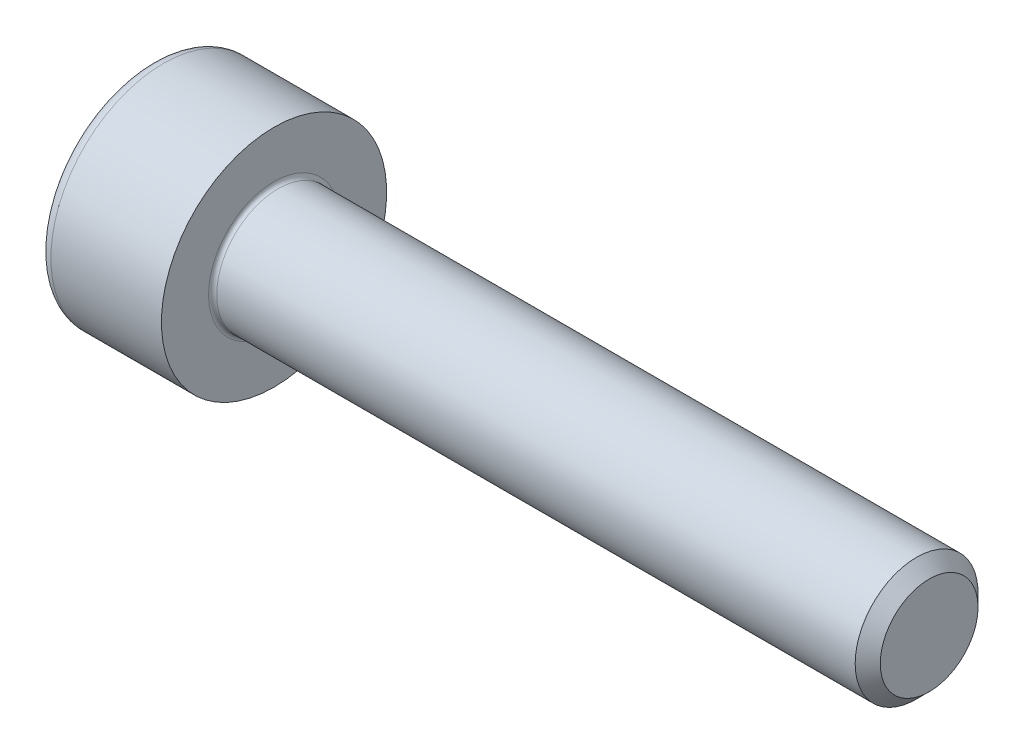
ISO-10303-21;
HEADER;
FILE_DESCRIPTION(('STEP AP214'),'2;1');
FILE_NAME('part.step','',(''),(''),'','','');
FILE_SCHEMA(('AUTOMOTIVE_DESIGN { 1 0 10303 214 1 1 1 1 }'));
ENDSEC;
DATA;
#1=APPLICATION_CONTEXT('core data for automotive mechanical design processes');
#2=APPLICATION_PROTOCOL_DEFINITION('international standard','automotive_design',2000,#1);
#3=PRODUCT_CONTEXT('',#1,'mechanical');
#4=PRODUCT('Part','Part','',(#3));
#5=PRODUCT_RELATED_PRODUCT_CATEGORY('part','',(#4));
#6=PRODUCT_DEFINITION_FORMATION('','',#4);
#7=PRODUCT_DEFINITION_CONTEXT('part definition',#1,'design');
#8=PRODUCT_DEFINITION('design','',#6,#7);
#9=PRODUCT_DEFINITION_SHAPE('','',#8);
#10=(LENGTH_UNIT() NAMED_UNIT(*) SI_UNIT(.MILLI.,.METRE.));
#11=(NAMED_UNIT(*) PLANE_ANGLE_UNIT() SI_UNIT($,.RADIAN.));
#12=(NAMED_UNIT(*) SI_UNIT($,.STERADIAN.) SOLID_ANGLE_UNIT());
#13=UNCERTAINTY_MEASURE_WITH_UNIT(LENGTH_MEASURE(1.E-05),#10,'distance_accuracy_value','');
#14=(GEOMETRIC_REPRESENTATION_CONTEXT(3) GLOBAL_UNCERTAINTY_ASSIGNED_CONTEXT((#13)) GLOBAL_UNIT_ASSIGNED_CONTEXT((#10,
#11,#12)) REPRESENTATION_CONTEXT('',''));
#15=CARTESIAN_POINT('',(0.,0.,0.));
#16=DIRECTION('',(0.,0.,1.));
#17=DIRECTION('',(1.,0.,0.));
#18=AXIS2_PLACEMENT_3D('',#15,#16,#17);
#19=CARTESIAN_POINT('',(-1.50499999995191,0.,0.));
#20=DIRECTION('',(-1.,0.,0.));
#21=DIRECTION('',(0.,0.,1.));
#22=AXIS2_PLACEMENT_3D('',#19,#20,#21);
#23=CONICAL_SURFACE('',#22,1.45203592694543,1.04719755110347);
#24=CARTESIAN_POINT('',(-0.666666666631954,-5.6843418860808E-11,0.));
#25=VERTEX_POINT('',#24);
#26=VERTEX_LOOP('',#25);
#27=FACE_BOUND('',#26,.T.);
#28=CARTESIAN_POINT('',(-1.49999999999004,1.25,0.721687836489904));
#29=CARTESIAN_POINT('',(-1.48168471568985,1.25,0.658260217059865));
#30=CARTESIAN_POINT('',(-1.46502792316932,1.25,0.594285091321008));
#31=CARTESIAN_POINT('',(-1.43595399209987,1.25,0.465227153334786));
#32=CARTESIAN_POINT('',(-1.42354713768306,1.25,0.40014204872408));
#33=CARTESIAN_POINT('',(-1.40423497430876,1.25,0.270778406577996));
#34=CARTESIAN_POINT('',(-1.3972011172141,1.25,0.206519767721449));
#35=CARTESIAN_POINT('',(-1.38880573004626,1.25,0.0777002896277511));
#36=CARTESIAN_POINT('',(-1.38743724619873,1.25,0.0131399182931021));
#37=CARTESIAN_POINT('',(-1.39029143131319,1.25,-0.10748420967335));
#38=CARTESIAN_POINT('',(-1.39381330322771,1.25,-0.163566066938273));
#39=CARTESIAN_POINT('',(-1.40497331291925,1.25,-0.275364426461425));
#40=CARTESIAN_POINT('',(-1.41261525920259,1.25,-0.331080542327595));
#41=CARTESIAN_POINT('',(-1.4317186458128,1.25,-0.443109217014839));
#42=CARTESIAN_POINT('',(-1.44326102636524,1.25,-0.49940760424794));
#43=CARTESIAN_POINT('',(-1.46945735050873,1.25,-0.611164931126897));
#44=CARTESIAN_POINT('',(-1.48410514295715,1.25,-0.666625301408834));
#45=CARTESIAN_POINT('',(-1.49999999999004,1.25,-0.721687836489906));
#46=B_SPLINE_CURVE_WITH_KNOTS('',3,(#28,#29,#30,#31,#32,#33,#34,#35,#36,#37,#38,#39,#40,#41,#42,
#43,#44,#45),.UNSPECIFIED.,.F.,.F.,(4,2,2,2,2,2,2,2,4),(0.,0.198135007230316,0.396746135656778,
0.590442253865621,0.783900555586254,0.952317364166839,1.12089012114027,1.2932010140725,
1.46517373346208),.UNSPECIFIED.);
#47=CARTESIAN_POINT('',(-1.49999999999004,1.25000000000124,0.721687836487752));
#48=VERTEX_POINT('',#47);
#49=CARTESIAN_POINT('',(-1.49999999998963,1.25,-0.721687836488469));
#50=VERTEX_POINT('',#49);
#51=EDGE_CURVE('E20',#48,#50,#46,.T.);
#52=ORIENTED_EDGE('',*,*,#51,.T.);
#53=CARTESIAN_POINT('',(-1.49999999999004,1.25000000000249,-0.721687836485598));
#54=CARTESIAN_POINT('',(-1.48168471568985,1.1950700702745,-0.753401646200618));
#55=CARTESIAN_POINT('',(-1.46502792316932,1.13966598617435,-0.785389209070047));
#56=CARTESIAN_POINT('',(-1.43595399209987,1.02789853331824,-0.849918178063157));
#57=CARTESIAN_POINT('',(-1.42354713768306,0.971533179317402,-0.88246073036851));
#58=CARTESIAN_POINT('',(-1.40423497430876,0.859500978892814,-0.947142551441552));
#59=CARTESIAN_POINT('',(-1.3972011172141,0.803851365230435,-0.979271870869826));
#60=CARTESIAN_POINT('',(-1.38880573004627,0.692290424699039,-1.04368160991667));
#61=CARTESIAN_POINT('',(-1.38743724619873,0.636379503045476,-1.075961795584));
#62=CARTESIAN_POINT('',(-1.3902914313132,0.531915943917184,-1.13627385956723));
#63=CARTESIAN_POINT('',(-1.39381330322771,0.483347630834347,-1.16431478819969));
#64=CARTESIAN_POINT('',(-1.40497331291925,0.386527411385872,-1.22021396796126));
#65=CARTESIAN_POINT('',(-1.41261525920259,0.338275839645572,-1.24807202589435));
#66=CARTESIAN_POINT('',(-1.4317186458128,0.241256161414117,-1.30408636323797));
#67=CARTESIAN_POINT('',(-1.44326102636524,0.192500327878158,-1.33223555685452));
#68=CARTESIAN_POINT('',(-1.46945735050873,0.0957156437419398,-1.388114220294));
#69=CARTESIAN_POINT('',(-1.48410514295715,0.047685554174491,-1.41584440543497));
#70=CARTESIAN_POINT('',(-1.49999999999004,-2.48886390330067E-12,-1.4433756729755));
#71=B_SPLINE_CURVE_WITH_KNOTS('',3,(#53,#54,#55,#56,#57,#58,#59,#60,#61,#62,#63,#64,#65,#66,#67,
#68,#69,#70),.UNSPECIFIED.,.F.,.F.,(4,2,2,2,2,2,2,2,4),(0.,0.198135007230316,0.396746135656778,
0.590442253865621,0.783900555586254,0.952317364166839,1.12089012114027,1.2932010140725,
1.46517373346208),.UNSPECIFIED.);
#72=CARTESIAN_POINT('',(-1.49999999999004,0.,-1.4433756729755));
#73=VERTEX_POINT('',#72);
#74=EDGE_CURVE('E81',#50,#73,#71,.T.);
#75=ORIENTED_EDGE('',*,*,#74,.T.);
#76=CARTESIAN_POINT('',(-1.49999999999004,2.48369834487562E-12,-1.4433756729755));
#77=CARTESIAN_POINT('',(-1.48168471568985,-0.0549299297255021,-1.41166186326048));
#78=CARTESIAN_POINT('',(-1.46502792316932,-0.110334013825656,-1.37967430039106));
#79=CARTESIAN_POINT('',(-1.43595399209988,-0.222101466681761,-1.31514533139794));
#80=CARTESIAN_POINT('',(-1.42354713768306,-0.2784668206826,-1.28260277909259));
#81=CARTESIAN_POINT('',(-1.40423497430876,-0.390499021107189,-1.21792095801955));
#82=CARTESIAN_POINT('',(-1.39720111721411,-0.446148634769568,-1.18579163859128));
#83=CARTESIAN_POINT('',(-1.38880573004627,-0.557709575300964,-1.12138189954443));
#84=CARTESIAN_POINT('',(-1.38743724619873,-0.613620496954527,-1.0891017138771));
#85=CARTESIAN_POINT('',(-1.3902914313132,-0.71808405608282,-1.02878964989388));
#86=CARTESIAN_POINT('',(-1.39381330322771,-0.766652369165655,-1.00074872126142));
#87=CARTESIAN_POINT('',(-1.40497331291926,-0.86347258861413,-0.94484954149984));
#88=CARTESIAN_POINT('',(-1.41261525920259,-0.911724160354429,-0.916991483566755));
#89=CARTESIAN_POINT('',(-1.43171864581281,-1.00874383858588,-0.860977146223134));
#90=CARTESIAN_POINT('',(-1.44326102636524,-1.05749967212184,-0.832827952606583));
#91=CARTESIAN_POINT('',(-1.46945735050874,-1.15428435625806,-0.776949289167105));
#92=CARTESIAN_POINT('',(-1.48410514295715,-1.20231444582551,-0.749219104026137));
#93=CARTESIAN_POINT('',(-1.49999999999004,-1.25000000000249,-0.721687836485601));
#94=B_SPLINE_CURVE_WITH_KNOTS('',3,(#76,#77,#78,#79,#80,#81,#82,#83,#84,#85,#86,#87,#88,#89,#90,
#91,#92,#93),.UNSPECIFIED.,.F.,.F.,(4,2,2,2,2,2,2,2,4),(0.,0.198135007230316,0.396746135656779,
0.590442253865623,0.783900555586256,0.95231736416684,1.12089012114027,1.2932010140725,
1.46517373346208),.UNSPECIFIED.);
#95=CARTESIAN_POINT('',(-1.49999999999004,-1.25000000000124,-0.721687836487754));
#96=VERTEX_POINT('',#95);
#97=EDGE_CURVE('E112',#73,#96,#94,.T.);
#98=ORIENTED_EDGE('',*,*,#97,.T.);
#99=CARTESIAN_POINT('',(-1.49999999999004,-1.25,-0.721687836489906));
#100=CARTESIAN_POINT('',(-1.48168471568985,-1.25,-0.658260217059866));
#101=CARTESIAN_POINT('',(-1.46502792316932,-1.25,-0.594285091321009));
#102=CARTESIAN_POINT('',(-1.43595399209987,-1.25,-0.465227153334787));
#103=CARTESIAN_POINT('',(-1.42354713768306,-1.25,-0.400142048724082));
#104=CARTESIAN_POINT('',(-1.40423497430876,-1.25,-0.270778406577997));
#105=CARTESIAN_POINT('',(-1.3972011172141,-1.25,-0.206519767721451));
#106=CARTESIAN_POINT('',(-1.38880573004626,-1.25,-0.0777002896277526));
#107=CARTESIAN_POINT('',(-1.38743724619873,-1.25,-0.0131399182931036));
#108=CARTESIAN_POINT('',(-1.39029143131319,-1.25,0.107484209673349));
#109=CARTESIAN_POINT('',(-1.39381330322771,-1.25,0.163566066938272));
#110=CARTESIAN_POINT('',(-1.40497331291925,-1.25,0.275364426461424));
#111=CARTESIAN_POINT('',(-1.41261525920259,-1.25,0.331080542327593));
#112=CARTESIAN_POINT('',(-1.4317186458128,-1.25,0.443109217014837));
#113=CARTESIAN_POINT('',(-1.44326102636524,-1.25,0.499407604247938));
#114=CARTESIAN_POINT('',(-1.46945735050873,-1.25,0.611164931126896));
#115=CARTESIAN_POINT('',(-1.48410514295715,-1.25,0.666625301408832));
#116=CARTESIAN_POINT('',(-1.49999999999004,-1.25,0.721687836489904));
#117=B_SPLINE_CURVE_WITH_KNOTS('',3,(#99,#100,#101,#102,#103,#104,#105,#106,#107,#108,#109,#110,
#111,#112,#113,#114,#115,#116),.UNSPECIFIED.,.F.,.F.,(4,2,2,2,2,2,2,2,4),(0.,0.198135007230316,
0.396746135656778,0.590442253865622,0.783900555586254,0.95231736416684,1.12089012114027,
1.2932010140725,1.46517373346208),.UNSPECIFIED.);
#118=CARTESIAN_POINT('',(-1.49999999999004,-1.25000000000124,0.72168783648775));
#119=VERTEX_POINT('',#118);
#120=EDGE_CURVE('E136',#96,#119,#117,.T.);
#121=ORIENTED_EDGE('',*,*,#120,.T.);
#122=CARTESIAN_POINT('',(-1.49999999999004,-1.25000000000249,0.721687836485597));
#123=CARTESIAN_POINT('',(-1.48168471568985,-1.1950700702745,0.753401646200617));
#124=CARTESIAN_POINT('',(-1.46502792316932,-1.13966598617435,0.785389209070045));
#125=CARTESIAN_POINT('',(-1.43595399209987,-1.02789853331824,0.849918178063156));
#126=CARTESIAN_POINT('',(-1.42354713768306,-0.971533179317404,0.882460730368509));
#127=CARTESIAN_POINT('',(-1.40423497430876,-0.859500978892816,0.947142551441551));
#128=CARTESIAN_POINT('',(-1.3972011172141,-0.803851365230436,0.979271870869825));
#129=CARTESIAN_POINT('',(-1.38880573004627,-0.692290424699041,1.04368160991667));
#130=CARTESIAN_POINT('',(-1.38743724619873,-0.636379503045478,1.075961795584));
#131=CARTESIAN_POINT('',(-1.39029143131319,-0.531915943917186,1.13627385956722));
#132=CARTESIAN_POINT('',(-1.39381330322771,-0.483347630834349,1.16431478819969));
#133=CARTESIAN_POINT('',(-1.40497331291925,-0.386527411385874,1.22021396796126));
#134=CARTESIAN_POINT('',(-1.41261525920259,-0.338275839645574,1.24807202589435));
#135=CARTESIAN_POINT('',(-1.4317186458128,-0.241256161414118,1.30408636323797));
#136=CARTESIAN_POINT('',(-1.44326102636524,-0.192500327878159,1.33223555685452));
#137=CARTESIAN_POINT('',(-1.46945735050873,-0.0957156437419405,1.388114220294));
#138=CARTESIAN_POINT('',(-1.48410514295715,-0.0476855541744915,1.41584440543497));
#139=CARTESIAN_POINT('',(-1.49999999999004,2.48832408244442E-12,1.4433756729755));
#140=B_SPLINE_CURVE_WITH_KNOTS('',3,(#122,#123,#124,#125,#126,#127,#128,#129,#130,#131,#132,
#133,#134,#135,#136,#137,#138,#139),.UNSPECIFIED.,.F.,.F.,(4,2,2,2,2,2,2,2,4),(0.,
0.198135007230316,0.396746135656778,0.590442253865622,0.783900555586254,0.95231736416684,
1.12089012114027,1.2932010140725,1.46517373346208),.UNSPECIFIED.);
#141=CARTESIAN_POINT('',(-1.49999999999004,0.,1.4433756729755));
#142=VERTEX_POINT('',#141);
#143=EDGE_CURVE('E145',#119,#142,#140,.T.);
#144=ORIENTED_EDGE('',*,*,#143,.T.);
#145=CARTESIAN_POINT('',(-1.49999999999005,-2.48462053856852E-12,1.4433756729755));
#146=CARTESIAN_POINT('',(-1.48168471568985,0.0549299297255012,1.41166186326048));
#147=CARTESIAN_POINT('',(-1.46502792316932,0.110334013825655,1.37967430039106));
#148=CARTESIAN_POINT('',(-1.43595399209988,0.22210146668176,1.31514533139794));
#149=CARTESIAN_POINT('',(-1.42354713768306,0.278466820682599,1.28260277909259));
#150=CARTESIAN_POINT('',(-1.40423497430876,0.390499021107188,1.21792095801955));
#151=CARTESIAN_POINT('',(-1.39720111721411,0.446148634769567,1.18579163859128));
#152=CARTESIAN_POINT('',(-1.38880573004627,0.557709575300963,1.12138189954443));
#153=CARTESIAN_POINT('',(-1.38743724619873,0.613620496954526,1.0891017138771));
#154=CARTESIAN_POINT('',(-1.3902914313132,0.718084056082818,1.02878964989388));
#155=CARTESIAN_POINT('',(-1.39381330322771,0.766652369165654,1.00074872126141));
#156=CARTESIAN_POINT('',(-1.40497331291926,0.863472588614129,0.944849541499838));
#157=CARTESIAN_POINT('',(-1.41261525920259,0.911724160354429,0.916991483566754));
#158=CARTESIAN_POINT('',(-1.4317186458128,1.00874383858588,0.860977146223132));
#159=CARTESIAN_POINT('',(-1.44326102636524,1.05749967212184,0.832827952606582));
#160=CARTESIAN_POINT('',(-1.46945735050874,1.15428435625806,0.776949289167103));
#161=CARTESIAN_POINT('',(-1.48410514295715,1.20231444582551,0.749219104026135));
#162=CARTESIAN_POINT('',(-1.49999999999004,1.25000000000249,0.721687836485599));
#163=B_SPLINE_CURVE_WITH_KNOTS('',3,(#145,#146,#147,#148,#149,#150,#151,#152,#153,#154,#155,
#156,#157,#158,#159,#160,#161,#162),.UNSPECIFIED.,.F.,.F.,(4,2,2,2,2,2,2,2,4),(0.,
0.198135007230316,0.396746135656779,0.590442253865623,0.783900555586256,0.952317364166841,
1.12089012114027,1.2932010140725,1.46517373346208),.UNSPECIFIED.);
#164=EDGE_CURVE('E83',#142,#48,#163,.T.);
#165=ORIENTED_EDGE('',*,*,#164,.T.);
#166=EDGE_LOOP('',(#52,#75,#98,#121,#144,#165));
#167=FACE_BOUND('',#166,.T.);
#168=ADVANCED_FACE('F16',(#27,#167),#23,.F.);
#169=CARTESIAN_POINT('',(-2.99999999999999,1.25,0.721687836487031));
#170=DIRECTION('',(0.,1.,0.));
#171=DIRECTION('',(0.,0.,1.));
#172=AXIS2_PLACEMENT_3D('',#169,#170,#171);
#173=PLANE('',#172);
#174=DIRECTION('',(1.,0.,0.));
#175=VECTOR('',#174,1.);
#176=CARTESIAN_POINT('',(-2.99999999999999,1.25,0.721687836487034));
#177=LINE('',#176,#175);
#178=CARTESIAN_POINT('',(-2.99999999999999,1.25,0.721687836487032));
#179=VERTEX_POINT('',#178);
#180=EDGE_CURVE('E86',#48,#179,#177,.F.);
#181=ORIENTED_EDGE('',*,*,#180,.T.);
#182=DIRECTION('',(0.,0.,1.));
#183=VECTOR('',#182,1.);
#184=CARTESIAN_POINT('',(-2.99999999999999,1.25,0.));
#185=LINE('',#184,#183);
#186=CARTESIAN_POINT('',(-2.99999999999999,1.25,-0.721687836487033));
#187=VERTEX_POINT('',#186);
#188=EDGE_CURVE('E91',#187,#179,#185,.T.);
#189=ORIENTED_EDGE('',*,*,#188,.F.);
#190=DIRECTION('',(1.,0.,0.));
#191=VECTOR('',#190,1.);
#192=CARTESIAN_POINT('',(-2.99999999999999,1.25,-0.721687836487033));
#193=LINE('',#192,#191);
#194=EDGE_CURVE('E89',#187,#50,#193,.T.);
#195=ORIENTED_EDGE('',*,*,#194,.T.);
#196=ORIENTED_EDGE('',*,*,#51,.F.);
#197=EDGE_LOOP('',(#181,#189,#195,#196));
#198=FACE_BOUND('',#197,.T.);
#199=ADVANCED_FACE('F77',(#198),#173,.F.);
#200=CARTESIAN_POINT('',(-2.99999999999999,0.,1.44337567297407));
#201=DIRECTION('',(0.,0.500000000000001,0.866025403784438));
#202=DIRECTION('',(0.,-0.866025403784438,0.500000000000001));
#203=AXIS2_PLACEMENT_3D('',#200,#201,#202);
#204=PLANE('',#203);
#205=DIRECTION('',(1.,0.,0.));
#206=VECTOR('',#205,1.);
#207=CARTESIAN_POINT('',(-2.99999999999999,0.,1.44337567297407));
#208=LINE('',#207,#206);
#209=CARTESIAN_POINT('',(-2.99999999999999,0.,1.44337567297407));
#210=VERTEX_POINT('',#209);
#211=EDGE_CURVE('E150',#142,#210,#208,.F.);
#212=ORIENTED_EDGE('',*,*,#211,.T.);
#213=DIRECTION('',(0.,-0.866025403784437,0.500000000000004));
#214=VECTOR('',#213,1.);
#215=CARTESIAN_POINT('',(-2.99999999999999,1.25,0.721687836487031));
#216=LINE('',#215,#214);
#217=EDGE_CURVE('E102',#179,#210,#216,.T.);
#218=ORIENTED_EDGE('',*,*,#217,.F.);
#219=ORIENTED_EDGE('',*,*,#180,.F.);
#220=ORIENTED_EDGE('',*,*,#164,.F.);
#221=EDGE_LOOP('',(#212,#218,#219,#220));
#222=FACE_BOUND('',#221,.T.);
#223=ADVANCED_FACE('F154',(#222),#204,.F.);
#224=CARTESIAN_POINT('',(-2.99999999999999,-1.25,0.721687836487033));
#225=DIRECTION('',(0.,-0.5,0.866025403784439));
#226=DIRECTION('',(0.,-0.866025403784439,-0.5));
#227=AXIS2_PLACEMENT_3D('',#224,#225,#226);
#228=PLANE('',#227);
#229=DIRECTION('',(1.,0.,0.));
#230=VECTOR('',#229,1.);
#231=CARTESIAN_POINT('',(-2.99999999999999,-1.25,0.721687836487032));
#232=LINE('',#231,#230);
#233=CARTESIAN_POINT('',(-2.99999999999999,-1.25,0.721687836487032));
#234=VERTEX_POINT('',#233);
#235=EDGE_CURVE('E144',#119,#234,#232,.F.);
#236=ORIENTED_EDGE('',*,*,#235,.T.);
#237=DIRECTION('',(0.,-0.866025403784437,-0.500000000000003));
#238=VECTOR('',#237,1.);
#239=CARTESIAN_POINT('',(-2.99999999999999,0.,1.44337567297407));
#240=LINE('',#239,#238);
#241=EDGE_CURVE('E281',#210,#234,#240,.T.);
#242=ORIENTED_EDGE('',*,*,#241,.F.);
#243=ORIENTED_EDGE('',*,*,#211,.F.);
#244=ORIENTED_EDGE('',*,*,#143,.F.);
#245=EDGE_LOOP('',(#236,#242,#243,#244));
#246=FACE_BOUND('',#245,.T.);
#247=ADVANCED_FACE('F132',(#246),#228,.F.);
#248=CARTESIAN_POINT('',(-2.99999999999999,-1.25,-0.721687836487032));
#249=DIRECTION('',(0.,-1.,0.));
#250=DIRECTION('',(1.,0.,0.));
#251=AXIS2_PLACEMENT_3D('',#248,#249,#250);
#252=PLANE('',#251);
#253=DIRECTION('',(1.,0.,0.));
#254=VECTOR('',#253,1.);
#255=CARTESIAN_POINT('',(-2.99999999999999,-1.25,-0.721687836487037));
#256=LINE('',#255,#254);
#257=CARTESIAN_POINT('',(-2.99999999999999,-1.25,-0.721687836487034));
#258=VERTEX_POINT('',#257);
#259=EDGE_CURVE('E143',#96,#258,#256,.F.);
#260=ORIENTED_EDGE('',*,*,#259,.T.);
#261=DIRECTION('',(0.,0.,1.));
#262=VECTOR('',#261,1.);
#263=CARTESIAN_POINT('',(-2.99999999999999,-1.25,0.));
#264=LINE('',#263,#262);
#265=EDGE_CURVE('E275',#234,#258,#264,.F.);
#266=ORIENTED_EDGE('',*,*,#265,.F.);
#267=ORIENTED_EDGE('',*,*,#235,.F.);
#268=ORIENTED_EDGE('',*,*,#120,.F.);
#269=EDGE_LOOP('',(#260,#266,#267,#268));
#270=FACE_BOUND('',#269,.T.);
#271=ADVANCED_FACE('F128',(#270),#252,.F.);
#272=CARTESIAN_POINT('',(-2.99999999999999,0.,-1.44337567297407));
#273=DIRECTION('',(0.,-0.5,-0.866025403784439));
#274=DIRECTION('',(0.,0.866025403784439,-0.5));
#275=AXIS2_PLACEMENT_3D('',#272,#273,#274);
#276=PLANE('',#275);
#277=DIRECTION('',(1.,0.,0.));
#278=VECTOR('',#277,1.);
#279=CARTESIAN_POINT('',(-2.99999999999999,0.,-1.44337567297407));
#280=LINE('',#279,#278);
#281=CARTESIAN_POINT('',(-2.99999999999999,0.,-1.44337567297407));
#282=VERTEX_POINT('',#281);
#283=EDGE_CURVE('E39',#73,#282,#280,.F.);
#284=ORIENTED_EDGE('',*,*,#283,.T.);
#285=DIRECTION('',(0.,0.866025403784437,-0.500000000000003));
#286=VECTOR('',#285,1.);
#287=CARTESIAN_POINT('',(-2.99999999999999,-1.25,-0.721687836487032));
#288=LINE('',#287,#286);
#289=EDGE_CURVE('E269',#258,#282,#288,.T.);
#290=ORIENTED_EDGE('',*,*,#289,.F.);
#291=ORIENTED_EDGE('',*,*,#259,.F.);
#292=ORIENTED_EDGE('',*,*,#97,.F.);
#293=EDGE_LOOP('',(#284,#290,#291,#292));
#294=FACE_BOUND('',#293,.T.);
#295=ADVANCED_FACE('F122',(#294),#276,.F.);
#296=CARTESIAN_POINT('',(-2.99999999999999,1.25,-0.721687836487033));
#297=DIRECTION('',(0.,0.5,-0.866025403784439));
#298=DIRECTION('',(0.,0.866025403784439,0.5));
#299=AXIS2_PLACEMENT_3D('',#296,#297,#298);
#300=PLANE('',#299);
#301=ORIENTED_EDGE('',*,*,#194,.F.);
#302=DIRECTION('',(0.,0.866025403784437,0.500000000000002));
#303=VECTOR('',#302,1.);
#304=CARTESIAN_POINT('',(-2.99999999999999,0.,-1.44337567297407));
#305=LINE('',#304,#303);
#306=EDGE_CURVE('E266',#282,#187,#305,.T.);
#307=ORIENTED_EDGE('',*,*,#306,.F.);
#308=ORIENTED_EDGE('',*,*,#283,.F.);
#309=ORIENTED_EDGE('',*,*,#74,.F.);
#310=EDGE_LOOP('',(#301,#307,#308,#309));
#311=FACE_BOUND('',#310,.T.);
#312=ADVANCED_FACE('F96',(#311),#300,.F.);
#313=CARTESIAN_POINT('',(-2.99999999999999,2.09668783648703,0.));
#314=DIRECTION('',(-1.,0.,0.));
#315=DIRECTION('',(0.,-1.,0.));
#316=AXIS2_PLACEMENT_3D('',#313,#314,#315);
#317=PLANE('',#316);
#318=ORIENTED_EDGE('',*,*,#289,.T.);
#319=ORIENTED_EDGE('',*,*,#306,.T.);
#320=ORIENTED_EDGE('',*,*,#188,.T.);
#321=ORIENTED_EDGE('',*,*,#217,.T.);
#322=ORIENTED_EDGE('',*,*,#241,.T.);
#323=ORIENTED_EDGE('',*,*,#265,.T.);
#324=EDGE_LOOP('',(#318,#319,#320,#321,#322,#323));
#325=FACE_BOUND('',#324,.T.);
#326=CARTESIAN_POINT('',(-2.99999999999999,0.,0.));
#327=DIRECTION('',(1.,0.,0.));
#328=DIRECTION('',(0.,1.,0.));
#329=AXIS2_PLACEMENT_3D('',#326,#327,#328);
#330=CIRCLE('',#329,2.45);
#331=CARTESIAN_POINT('',(-2.99999999999999,2.45,0.));
#332=VERTEX_POINT('',#331);
#333=EDGE_CURVE('E224',#332,#332,#330,.T.);
#334=ORIENTED_EDGE('',*,*,#333,.F.);
#335=EDGE_LOOP('',(#334));
#336=FACE_BOUND('',#335,.T.);
#337=ADVANCED_FACE('F121',(#325,#336),#317,.T.);
#338=CARTESIAN_POINT('',(-2.69999999999999,0.,0.));
#339=DIRECTION('',(1.,0.,0.));
#340=DIRECTION('',(0.,0.,-1.));
#341=AXIS2_PLACEMENT_3D('',#338,#339,#340);
#342=TOROIDAL_SURFACE('',#341,2.45,0.3);
#343=CARTESIAN_POINT('',(-2.69999999999999,0.,0.));
#344=DIRECTION('',(1.,0.,0.));
#345=DIRECTION('',(0.,1.,0.));
#346=AXIS2_PLACEMENT_3D('',#343,#344,#345);
#347=CIRCLE('',#346,2.75);
#348=CARTESIAN_POINT('',(-2.69999999999999,2.75,0.));
#349=VERTEX_POINT('',#348);
#350=EDGE_CURVE('E302',#349,#349,#347,.T.);
#351=ORIENTED_EDGE('',*,*,#350,.F.);
#352=EDGE_LOOP('',(#351));
#353=FACE_BOUND('',#352,.T.);
#354=ORIENTED_EDGE('',*,*,#333,.T.);
#355=EDGE_LOOP('',(#354));
#356=FACE_BOUND('',#355,.T.);
#357=ADVANCED_FACE('F208',(#353,#356),#342,.T.);
#358=CARTESIAN_POINT('',(-1.5,0.,0.));
#359=DIRECTION('',(1.,0.,0.));
#360=DIRECTION('',(0.,1.,0.));
#361=AXIS2_PLACEMENT_3D('',#358,#359,#360);
#362=CYLINDRICAL_SURFACE('',#361,2.75);
#363=ORIENTED_EDGE('',*,*,#350,.T.);
#364=EDGE_LOOP('',(#363));
#365=FACE_BOUND('',#364,.T.);
#366=CARTESIAN_POINT('',(0.,0.,0.));
#367=DIRECTION('',(1.,0.,0.));
#368=DIRECTION('',(0.,1.,0.));
#369=AXIS2_PLACEMENT_3D('',#366,#367,#368);
#370=CIRCLE('',#369,2.75);
#371=CARTESIAN_POINT('',(0.,2.75,0.));
#372=VERTEX_POINT('',#371);
#373=EDGE_CURVE('E110',#372,#372,#370,.T.);
#374=ORIENTED_EDGE('',*,*,#373,.F.);
#375=EDGE_LOOP('',(#374));
#376=FACE_BOUND('',#375,.T.);
#377=ADVANCED_FACE('F205',(#365,#376),#362,.T.);
#378=CARTESIAN_POINT('',(16.,0.75,0.));
#379=DIRECTION('',(1.,0.,0.));
#380=DIRECTION('',(0.,1.,0.));
#381=AXIS2_PLACEMENT_3D('',#378,#379,#380);
#382=PLANE('',#381);
#383=CARTESIAN_POINT('',(15.9999999999627,0.,0.));
#384=DIRECTION('',(-1.,0.,0.));
#385=DIRECTION('',(0.,0.,1.));
#386=AXIS2_PLACEMENT_3D('',#383,#384,#385);
#387=CIRCLE('',#386,1.19327500004829);
#388=CARTESIAN_POINT('',(15.9999999999627,0.,1.19327500004829));
#389=VERTEX_POINT('',#388);
#390=EDGE_CURVE('E293',#389,#389,#387,.T.);
#391=ORIENTED_EDGE('',*,*,#390,.F.);
#392=EDGE_LOOP('',(#391));
#393=FACE_BOUND('',#392,.T.);
#394=ADVANCED_FACE('F202',(#393),#382,.T.);
#395=CARTESIAN_POINT('',(0.,2.125,0.));
#396=DIRECTION('',(1.,0.,0.));
#397=DIRECTION('',(0.,1.,0.));
#398=AXIS2_PLACEMENT_3D('',#395,#396,#397);
#399=PLANE('',#398);
#400=CARTESIAN_POINT('',(0.,0.,0.));
#401=DIRECTION('',(1.,0.,0.));
#402=DIRECTION('',(0.,1.,0.));
#403=AXIS2_PLACEMENT_3D('',#400,#401,#402);
#404=CIRCLE('',#403,1.6);
#405=CARTESIAN_POINT('',(0.,1.6,0.));
#406=VERTEX_POINT('',#405);
#407=EDGE_CURVE('E189',#406,#406,#404,.F.);
#408=ORIENTED_EDGE('',*,*,#407,.T.);
#409=EDGE_LOOP('',(#408));
#410=FACE_BOUND('',#409,.T.);
#411=ORIENTED_EDGE('',*,*,#373,.T.);
#412=EDGE_LOOP('',(#411));
#413=FACE_BOUND('',#412,.T.);
#414=ADVANCED_FACE('F193',(#410,#413),#399,.T.);
#415=CARTESIAN_POINT('',(15.6932750001033,0.,0.));
#416=DIRECTION('',(-1.,0.,0.));
#417=DIRECTION('',(0.,0.,1.));
#418=AXIS2_PLACEMENT_3D('',#415,#416,#417);
#419=CONICAL_SURFACE('',#418,1.49999999990769,0.785398163397448);
#420=ORIENTED_EDGE('',*,*,#390,.T.);
#421=EDGE_LOOP('',(#420));
#422=FACE_BOUND('',#421,.T.);
#423=CARTESIAN_POINT('',(15.693275,0.,0.));
#424=DIRECTION('',(1.,0.,0.));
#425=DIRECTION('',(0.,1.,0.));
#426=AXIS2_PLACEMENT_3D('',#423,#424,#425);
#427=CIRCLE('',#426,1.5);
#428=CARTESIAN_POINT('',(15.693275,1.5,0.));
#429=VERTEX_POINT('',#428);
#430=EDGE_CURVE('E30',#429,#429,#427,.F.);
#431=ORIENTED_EDGE('',*,*,#430,.F.);
#432=EDGE_LOOP('',(#431));
#433=FACE_BOUND('',#432,.T.);
#434=ADVANCED_FACE('F171',(#422,#433),#419,.T.);
#435=CARTESIAN_POINT('',(0.100000000000002,0.,0.));
#436=DIRECTION('',(1.,0.,0.));
#437=DIRECTION('',(0.,0.,-1.));
#438=AXIS2_PLACEMENT_3D('',#435,#436,#437);
#439=TOROIDAL_SURFACE('',#438,1.6,0.1);
#440=CARTESIAN_POINT('',(0.100000000000003,0.,0.));
#441=DIRECTION('',(1.,0.,0.));
#442=DIRECTION('',(0.,1.,0.));
#443=AXIS2_PLACEMENT_3D('',#440,#441,#442);
#444=CIRCLE('',#443,1.5);
#445=CARTESIAN_POINT('',(0.100000000000003,1.5,0.));
#446=VERTEX_POINT('',#445);
#447=EDGE_CURVE('E11',#446,#446,#444,.T.);
#448=ORIENTED_EDGE('',*,*,#447,.F.);
#449=EDGE_LOOP('',(#448));
#450=FACE_BOUND('',#449,.T.);
#451=ORIENTED_EDGE('',*,*,#407,.F.);
#452=EDGE_LOOP('',(#451));
#453=FACE_BOUND('',#452,.T.);
#454=ADVANCED_FACE('F165',(#450,#453),#439,.F.);
#455=CARTESIAN_POINT('',(8.6533625,0.,0.));
#456=DIRECTION('',(1.,0.,0.));
#457=DIRECTION('',(0.,1.,0.));
#458=AXIS2_PLACEMENT_3D('',#455,#456,#457);
#459=CYLINDRICAL_SURFACE('',#458,1.5);
#460=ORIENTED_EDGE('',*,*,#447,.T.);
#461=EDGE_LOOP('',(#460));
#462=FACE_BOUND('',#461,.T.);
#463=ORIENTED_EDGE('',*,*,#430,.T.);
#464=EDGE_LOOP('',(#463));
#465=FACE_BOUND('',#464,.T.);
#466=ADVANCED_FACE('F163',(#462,#465),#459,.T.);
#467=CLOSED_SHELL('',(#168,#199,#223,#247,#271,#295,#312,#337,#357,#377,#394,#414,#434,#454,#466));
#468=MANIFOLD_SOLID_BREP('B1',#467);
#469=ADVANCED_BREP_SHAPE_REPRESENTATION('',(#18,#468),#14);
#470=SHAPE_DEFINITION_REPRESENTATION(#9,#469);
ENDSEC;
END-ISO-10303-21;
